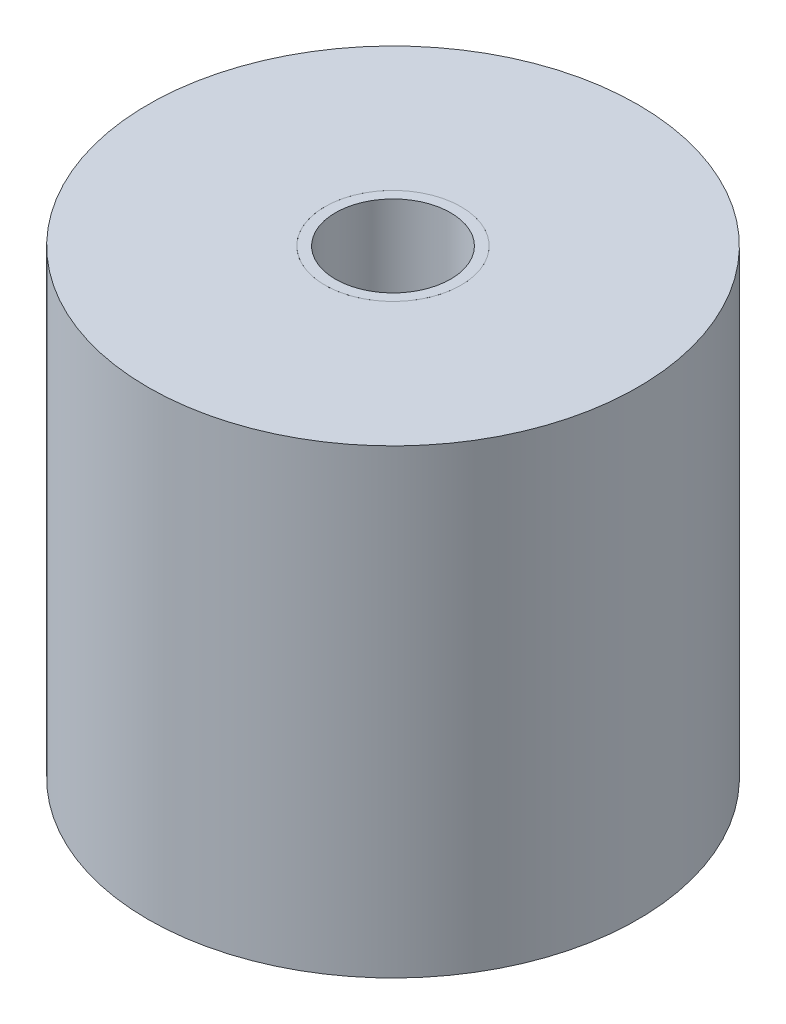
ISO-10303-21;
HEADER;
FILE_DESCRIPTION(('STEP AP214'),'2;1');
FILE_NAME('part.step','',(''),(''),'','','');
FILE_SCHEMA(('AUTOMOTIVE_DESIGN { 1 0 10303 214 1 1 1 1 }'));
ENDSEC;
DATA;
#1=APPLICATION_CONTEXT('core data for automotive mechanical design processes');
#2=APPLICATION_PROTOCOL_DEFINITION('international standard','automotive_design',2000,#1);
#3=PRODUCT_CONTEXT('',#1,'mechanical');
#4=PRODUCT('Part','Part','',(#3));
#5=PRODUCT_RELATED_PRODUCT_CATEGORY('part','',(#4));
#6=PRODUCT_DEFINITION_FORMATION('','',#4);
#7=PRODUCT_DEFINITION_CONTEXT('part definition',#1,'design');
#8=PRODUCT_DEFINITION('design','',#6,#7);
#9=PRODUCT_DEFINITION_SHAPE('','',#8);
#10=(LENGTH_UNIT() NAMED_UNIT(*) SI_UNIT(.MILLI.,.METRE.));
#11=(NAMED_UNIT(*) PLANE_ANGLE_UNIT() SI_UNIT($,.RADIAN.));
#12=(NAMED_UNIT(*) SI_UNIT($,.STERADIAN.) SOLID_ANGLE_UNIT());
#13=UNCERTAINTY_MEASURE_WITH_UNIT(LENGTH_MEASURE(1.E-05),#10,'distance_accuracy_value','');
#14=(GEOMETRIC_REPRESENTATION_CONTEXT(3) GLOBAL_UNCERTAINTY_ASSIGNED_CONTEXT((#13)) GLOBAL_UNIT_ASSIGNED_CONTEXT((#10,
#11,#12)) REPRESENTATION_CONTEXT('',''));
#15=CARTESIAN_POINT('',(0.,0.,0.));
#16=DIRECTION('',(0.,0.,1.));
#17=DIRECTION('',(1.,0.,0.));
#18=AXIS2_PLACEMENT_3D('',#15,#16,#17);
#19=CARTESIAN_POINT('',(0.,9.,0.));
#20=DIRECTION('',(0.,-1.,0.));
#21=DIRECTION('',(0.,0.,-1.));
#22=AXIS2_PLACEMENT_3D('',#19,#20,#21);
#23=CYLINDRICAL_SURFACE('',#22,3.75);
#24=CARTESIAN_POINT('',(0.,9.,0.));
#25=DIRECTION('',(0.,1.,0.));
#26=DIRECTION('',(0.,0.,1.));
#27=AXIS2_PLACEMENT_3D('',#24,#25,#26);
#28=CIRCLE('',#27,3.75);
#29=CARTESIAN_POINT('',(0.,9.,3.75));
#30=VERTEX_POINT('',#29);
#31=EDGE_CURVE('P0_E9',#30,#30,#28,.T.);
#32=ORIENTED_EDGE('',*,*,#31,.F.);
#33=EDGE_LOOP('',(#32));
#34=FACE_BOUND('',#33,.T.);
#35=CARTESIAN_POINT('',(0.,-1.,0.));
#36=DIRECTION('',(0.,-1.,0.));
#37=DIRECTION('',(0.,0.,-1.));
#38=AXIS2_PLACEMENT_3D('',#35,#36,#37);
#39=CIRCLE('',#38,3.75);
#40=CARTESIAN_POINT('',(0.,-1.,-3.75));
#41=VERTEX_POINT('',#40);
#42=EDGE_CURVE('P0_E24',#41,#41,#39,.T.);
#43=ORIENTED_EDGE('',*,*,#42,.F.);
#44=EDGE_LOOP('',(#43));
#45=FACE_BOUND('',#44,.T.);
#46=ADVANCED_FACE('P0_F14',(#34,#45),#23,.T.);
#47=CARTESIAN_POINT('',(0.,9.,0.));
#48=DIRECTION('',(0.,1.,0.));
#49=DIRECTION('',(0.,0.,1.));
#50=AXIS2_PLACEMENT_3D('',#47,#48,#49);
#51=PLANE('',#50);
#52=CARTESIAN_POINT('',(0.,9.,0.));
#53=DIRECTION('',(0.,1.,0.));
#54=DIRECTION('',(0.,0.,1.));
#55=AXIS2_PLACEMENT_3D('',#52,#53,#54);
#56=CIRCLE('',#55,3.175);
#57=CARTESIAN_POINT('',(0.,9.,3.175));
#58=VERTEX_POINT('',#57);
#59=EDGE_CURVE('P0_E20',#58,#58,#56,.T.);
#60=ORIENTED_EDGE('',*,*,#59,.F.);
#61=EDGE_LOOP('',(#60));
#62=FACE_BOUND('',#61,.T.);
#63=ORIENTED_EDGE('',*,*,#31,.T.);
#64=EDGE_LOOP('',(#63));
#65=FACE_BOUND('',#64,.T.);
#66=ADVANCED_FACE('P0_F43',(#62,#65),#51,.T.);
#67=CARTESIAN_POINT('',(0.,-8.98025612106916,0.));
#68=DIRECTION('',(0.,1.,0.));
#69=DIRECTION('',(0.,0.,1.));
#70=AXIS2_PLACEMENT_3D('',#67,#68,#69);
#71=CYLINDRICAL_SURFACE('',#70,3.175);
#72=ORIENTED_EDGE('',*,*,#59,.T.);
#73=EDGE_LOOP('',(#72));
#74=FACE_BOUND('',#73,.T.);
#75=CARTESIAN_POINT('',(0.,-1.,0.));
#76=DIRECTION('',(0.,-1.,0.));
#77=DIRECTION('',(0.,0.,-1.));
#78=AXIS2_PLACEMENT_3D('',#75,#76,#77);
#79=CIRCLE('',#78,3.175);
#80=CARTESIAN_POINT('',(0.,-1.,-3.175));
#81=VERTEX_POINT('',#80);
#82=EDGE_CURVE('P0_E28',#81,#81,#79,.T.);
#83=ORIENTED_EDGE('',*,*,#82,.T.);
#84=EDGE_LOOP('',(#83));
#85=FACE_BOUND('',#84,.T.);
#86=ADVANCED_FACE('P0_F34',(#74,#85),#71,.F.);
#87=CARTESIAN_POINT('',(-3.75,-1.,0.));
#88=DIRECTION('',(0.,-1.,0.));
#89=DIRECTION('',(0.,0.,-1.));
#90=AXIS2_PLACEMENT_3D('',#87,#88,#89);
#91=PLANE('',#90);
#92=ORIENTED_EDGE('',*,*,#82,.F.);
#93=EDGE_LOOP('',(#92));
#94=FACE_BOUND('',#93,.T.);
#95=ORIENTED_EDGE('',*,*,#42,.T.);
#96=EDGE_LOOP('',(#95));
#97=FACE_BOUND('',#96,.T.);
#98=ADVANCED_FACE('P0_F36',(#94,#97),#91,.T.);
#99=CLOSED_SHELL('',(#46,#66,#86,#98));
#100=MANIFOLD_SOLID_BREP('P0_B1',#99);
#101=CARTESIAN_POINT('',(0.,-16.4,0.));
#102=DIRECTION('',(0.,-1.,0.));
#103=DIRECTION('',(0.,0.,-1.));
#104=AXIS2_PLACEMENT_3D('',#101,#102,#103);
#105=CYLINDRICAL_SURFACE('',#104,3.75);
#106=CARTESIAN_POINT('',(0.,9.,0.));
#107=DIRECTION('',(0.,-1.,0.));
#108=DIRECTION('',(0.,0.,-1.));
#109=AXIS2_PLACEMENT_3D('',#106,#107,#108);
#110=CIRCLE('',#109,3.75);
#111=CARTESIAN_POINT('',(0.,9.,-3.75));
#112=VERTEX_POINT('',#111);
#113=EDGE_CURVE('P1_E10',#112,#112,#110,.T.);
#114=ORIENTED_EDGE('',*,*,#113,.F.);
#115=EDGE_LOOP('',(#114));
#116=FACE_BOUND('',#115,.T.);
#117=CARTESIAN_POINT('',(0.,-1.,0.));
#118=DIRECTION('',(0.,-1.,0.));
#119=DIRECTION('',(0.,0.,-1.));
#120=AXIS2_PLACEMENT_3D('',#117,#118,#119);
#121=CIRCLE('',#120,3.75);
#122=CARTESIAN_POINT('',(0.,-1.,-3.75));
#123=VERTEX_POINT('',#122);
#124=EDGE_CURVE('P1_E29',#123,#123,#121,.T.);
#125=ORIENTED_EDGE('',*,*,#124,.T.);
#126=EDGE_LOOP('',(#125));
#127=FACE_BOUND('',#126,.T.);
#128=ADVANCED_FACE('P1_F15',(#116,#127),#105,.F.);
#129=CARTESIAN_POINT('',(-3.75,9.,0.));
#130=DIRECTION('',(0.,-1.,0.));
#131=DIRECTION('',(0.,0.,-1.));
#132=AXIS2_PLACEMENT_3D('',#129,#130,#131);
#133=PLANE('',#132);
#134=CARTESIAN_POINT('',(0.,9.,0.));
#135=DIRECTION('',(0.,-1.,0.));
#136=DIRECTION('',(0.,0.,-1.));
#137=AXIS2_PLACEMENT_3D('',#134,#135,#136);
#138=CIRCLE('',#137,13.5);
#139=CARTESIAN_POINT('',(0.,9.,-13.5));
#140=VERTEX_POINT('',#139);
#141=EDGE_CURVE('P1_E21',#140,#140,#138,.T.);
#142=ORIENTED_EDGE('',*,*,#141,.F.);
#143=EDGE_LOOP('',(#142));
#144=FACE_BOUND('',#143,.T.);
#145=ORIENTED_EDGE('',*,*,#113,.T.);
#146=EDGE_LOOP('',(#145));
#147=FACE_BOUND('',#146,.T.);
#148=ADVANCED_FACE('P1_F48',(#144,#147),#133,.F.);
#149=CARTESIAN_POINT('',(0.,-16.4,0.));
#150=DIRECTION('',(0.,-1.,0.));
#151=DIRECTION('',(0.,0.,-1.));
#152=AXIS2_PLACEMENT_3D('',#149,#150,#151);
#153=CYLINDRICAL_SURFACE('',#152,13.5);
#154=CARTESIAN_POINT('',(0.,-16.4,0.));
#155=DIRECTION('',(0.,-1.,0.));
#156=DIRECTION('',(0.,0.,-1.));
#157=AXIS2_PLACEMENT_3D('',#154,#155,#156);
#158=CIRCLE('',#157,13.5);
#159=CARTESIAN_POINT('',(0.,-16.4,-13.5));
#160=VERTEX_POINT('',#159);
#161=EDGE_CURVE('P1_E25',#160,#160,#158,.T.);
#162=ORIENTED_EDGE('',*,*,#161,.F.);
#163=EDGE_LOOP('',(#162));
#164=FACE_BOUND('',#163,.T.);
#165=ORIENTED_EDGE('',*,*,#141,.T.);
#166=EDGE_LOOP('',(#165));
#167=FACE_BOUND('',#166,.T.);
#168=ADVANCED_FACE('P1_F44',(#164,#167),#153,.T.);
#169=CARTESIAN_POINT('',(-13.5,-16.4,0.));
#170=DIRECTION('',(0.,1.,0.));
#171=DIRECTION('',(0.,0.,1.));
#172=AXIS2_PLACEMENT_3D('',#169,#170,#171);
#173=PLANE('',#172);
#174=ORIENTED_EDGE('',*,*,#161,.T.);
#175=EDGE_LOOP('',(#174));
#176=FACE_BOUND('',#175,.T.);
#177=ADVANCED_FACE('P1_F38',(#176),#173,.F.);
#178=CARTESIAN_POINT('',(-3.75,-1.,0.));
#179=DIRECTION('',(0.,-1.,0.));
#180=DIRECTION('',(0.,0.,-1.));
#181=AXIS2_PLACEMENT_3D('',#178,#179,#180);
#182=PLANE('',#181);
#183=ORIENTED_EDGE('',*,*,#124,.F.);
#184=EDGE_LOOP('',(#183));
#185=FACE_BOUND('',#184,.T.);
#186=ADVANCED_FACE('P1_F36',(#185),#182,.F.);
#187=CLOSED_SHELL('',(#128,#148,#168,#177,#186));
#188=MANIFOLD_SOLID_BREP('P1_B1',#187);
#189=ADVANCED_BREP_SHAPE_REPRESENTATION('',(#18,#100,#188),#14);
#190=SHAPE_DEFINITION_REPRESENTATION(#9,#189);
ENDSEC;
END-ISO-10303-21;
